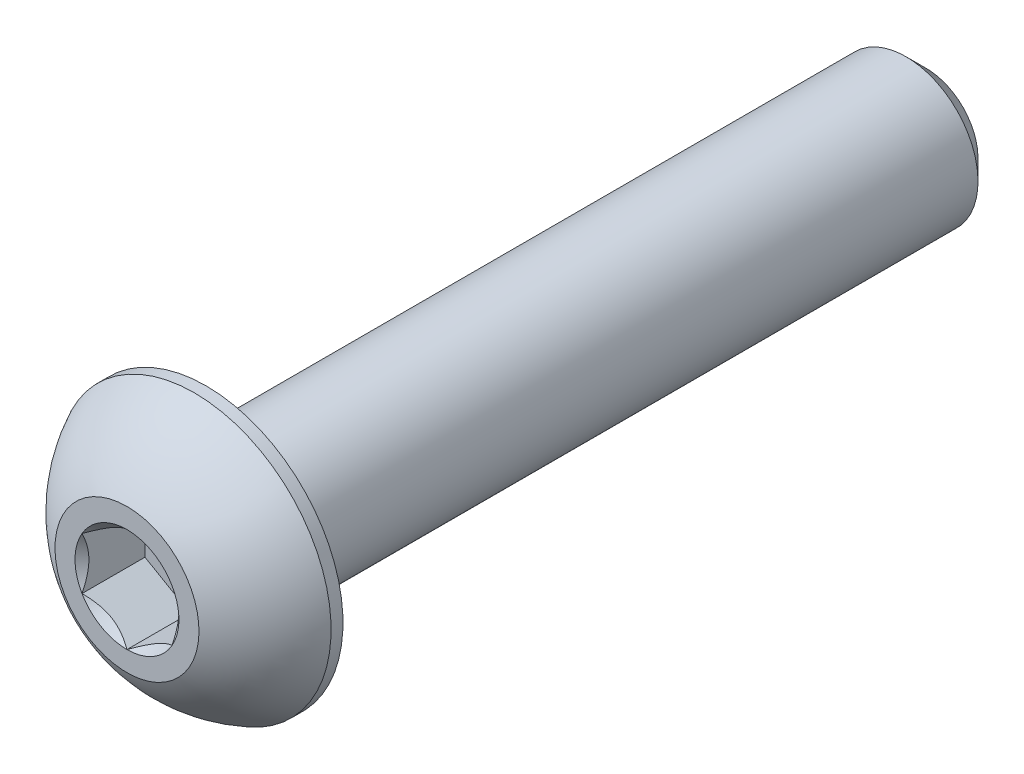
ISO-10303-21;
HEADER;
FILE_DESCRIPTION(('STEP AP214'),'2;1');
FILE_NAME('part.step','',(''),(''),'','','');
FILE_SCHEMA(('AUTOMOTIVE_DESIGN { 1 0 10303 214 1 1 1 1 }'));
ENDSEC;
DATA;
#1=APPLICATION_CONTEXT('core data for automotive mechanical design processes');
#2=APPLICATION_PROTOCOL_DEFINITION('international standard','automotive_design',2000,#1);
#3=PRODUCT_CONTEXT('',#1,'mechanical');
#4=PRODUCT('Part','Part','',(#3));
#5=PRODUCT_RELATED_PRODUCT_CATEGORY('part','',(#4));
#6=PRODUCT_DEFINITION_FORMATION('','',#4);
#7=PRODUCT_DEFINITION_CONTEXT('part definition',#1,'design');
#8=PRODUCT_DEFINITION('design','',#6,#7);
#9=PRODUCT_DEFINITION_SHAPE('','',#8);
#10=(LENGTH_UNIT() NAMED_UNIT(*) SI_UNIT(.MILLI.,.METRE.));
#11=(NAMED_UNIT(*) PLANE_ANGLE_UNIT() SI_UNIT($,.RADIAN.));
#12=(NAMED_UNIT(*) SI_UNIT($,.STERADIAN.) SOLID_ANGLE_UNIT());
#13=UNCERTAINTY_MEASURE_WITH_UNIT(LENGTH_MEASURE(1.E-05),#10,'distance_accuracy_value','');
#14=(GEOMETRIC_REPRESENTATION_CONTEXT(3) GLOBAL_UNCERTAINTY_ASSIGNED_CONTEXT((#13)) GLOBAL_UNIT_ASSIGNED_CONTEXT((#10,
#11,#12)) REPRESENTATION_CONTEXT('',''));
#15=CARTESIAN_POINT('',(0.,0.,0.));
#16=DIRECTION('',(0.,0.,1.));
#17=DIRECTION('',(1.,0.,0.));
#18=AXIS2_PLACEMENT_3D('',#15,#16,#17);
#19=CARTESIAN_POINT('',(0.,0.,11.1));
#20=DIRECTION('',(0.,0.,-1.));
#21=DIRECTION('',(0.,1.,0.));
#22=AXIS2_PLACEMENT_3D('',#19,#20,#21);
#23=PLANE('',#22);
#24=CARTESIAN_POINT('',(0.,0.,11.1));
#25=DIRECTION('',(0.,0.,1.));
#26=DIRECTION('',(1.,0.,0.));
#27=AXIS2_PLACEMENT_3D('',#24,#25,#26);
#28=CIRCLE('',#27,1.44337567297406);
#29=CARTESIAN_POINT('',(0.,1.44337567297406,11.1));
#30=VERTEX_POINT('',#29);
#31=CARTESIAN_POINT('',(-1.25,0.721687836487033,11.1));
#32=VERTEX_POINT('',#31);
#33=EDGE_CURVE('E216',#30,#32,#28,.T.);
#34=ORIENTED_EDGE('',*,*,#33,.F.);
#35=CARTESIAN_POINT('',(1.25,0.721687836487032,11.1));
#36=VERTEX_POINT('',#35);
#37=EDGE_CURVE('E218',#36,#30,#28,.T.);
#38=ORIENTED_EDGE('',*,*,#37,.F.);
#39=CARTESIAN_POINT('',(1.25,-0.721687836487032,11.1));
#40=VERTEX_POINT('',#39);
#41=EDGE_CURVE('E56',#40,#36,#28,.T.);
#42=ORIENTED_EDGE('',*,*,#41,.F.);
#43=CARTESIAN_POINT('',(0.,-1.44337567297406,11.1));
#44=VERTEX_POINT('',#43);
#45=EDGE_CURVE('E63',#44,#40,#28,.T.);
#46=ORIENTED_EDGE('',*,*,#45,.F.);
#47=CARTESIAN_POINT('',(-1.25,-0.721687836487033,11.1));
#48=VERTEX_POINT('',#47);
#49=EDGE_CURVE('E223',#48,#44,#28,.T.);
#50=ORIENTED_EDGE('',*,*,#49,.F.);
#51=EDGE_CURVE('E220',#32,#48,#28,.T.);
#52=ORIENTED_EDGE('',*,*,#51,.F.);
#53=EDGE_LOOP('',(#34,#38,#42,#46,#50,#52));
#54=FACE_BOUND('',#53,.T.);
#55=CARTESIAN_POINT('',(0.,0.,11.1));
#56=DIRECTION('',(0.,0.,1.));
#57=DIRECTION('',(0.,-1.,0.));
#58=AXIS2_PLACEMENT_3D('',#55,#56,#57);
#59=CIRCLE('',#58,2.);
#60=CARTESIAN_POINT('',(0.,2.,11.1));
#61=VERTEX_POINT('',#60);
#62=EDGE_CURVE('E50',#61,#61,#59,.T.);
#63=ORIENTED_EDGE('',*,*,#62,.T.);
#64=EDGE_LOOP('',(#63));
#65=FACE_BOUND('',#64,.T.);
#66=ADVANCED_FACE('F37',(#54,#65),#23,.F.);
#67=CARTESIAN_POINT('',(0.,0.,7.37355614973262));
#68=DIRECTION('',(0.,0.,1.));
#69=DIRECTION('',(0.,1.,0.));
#70=AXIS2_PLACEMENT_3D('',#67,#68,#69);
#71=SPHERICAL_SURFACE('',#70,4.22922968981298);
#72=CARTESIAN_POINT('',(0.,0.,9.23));
#73=DIRECTION('',(0.,0.,1.));
#74=DIRECTION('',(0.,-1.,0.));
#75=AXIS2_PLACEMENT_3D('',#72,#73,#74);
#76=CIRCLE('',#75,3.8);
#77=CARTESIAN_POINT('',(0.,3.8,9.23));
#78=VERTEX_POINT('',#77);
#79=EDGE_CURVE('E162',#78,#78,#76,.T.);
#80=CARTESIAN_POINT('',(0.,2.,11.1));
#81=CARTESIAN_POINT('',(0.,2.02421343985613,11.0870045740355));
#82=CARTESIAN_POINT('',(0.,2.04830018323974,11.0737730870349));
#83=CARTESIAN_POINT('',(0.,2.09621120342125,11.0468431584943));
#84=CARTESIAN_POINT('',(0.,2.12003548021917,11.0331447169543));
#85=CARTESIAN_POINT('',(0.,2.16741249358867,11.005286046868));
#86=CARTESIAN_POINT('',(0.,2.19096523016025,10.9911258183216));
#87=CARTESIAN_POINT('',(0.,2.23779021933682,10.962348964764));
#88=CARTESIAN_POINT('',(0.,2.2610624719418,10.9477323397528));
#89=CARTESIAN_POINT('',(0.,2.30731764886071,10.9180482444859));
#90=CARTESIAN_POINT('',(0.,2.33030057317464,10.9029807742302));
#91=CARTESIAN_POINT('',(0.,2.37596836104235,10.8724007144171));
#92=CARTESIAN_POINT('',(0.,2.39865322459612,10.8568881248597));
#93=CARTESIAN_POINT('',(0.,2.44371627121513,10.8254237206041));
#94=CARTESIAN_POINT('',(0.,2.46609445428037,10.8094719059059));
#95=CARTESIAN_POINT('',(0.,2.51053563686181,10.7771351126683));
#96=CARTESIAN_POINT('',(0.,2.532598636378,10.7607501341289));
#97=CARTESIAN_POINT('',(0.,2.57640106852492,10.7275532390328));
#98=CARTESIAN_POINT('',(0.,2.59814050115564,10.7107413224761));
#99=CARTESIAN_POINT('',(0.,2.64128753915153,10.6766969394119));
#100=CARTESIAN_POINT('',(0.,2.66269514451671,10.6594644729043));
#101=CARTESIAN_POINT('',(0.,2.70517039368395,10.624585537797));
#102=CARTESIAN_POINT('',(0.,2.72623803748602,10.6069390691974));
#103=CARTESIAN_POINT('',(0.,2.76802535840618,10.5712388350756));
#104=CARTESIAN_POINT('',(0.,2.78874503552428,10.5531850695534));
#105=CARTESIAN_POINT('',(0.,2.82982855017313,10.5166771015172));
#106=CARTESIAN_POINT('',(0.,2.85019238770389,10.4982228990032));
#107=CARTESIAN_POINT('',(0.,2.89055648548394,10.460921069069));
#108=CARTESIAN_POINT('',(0.,2.91055674573324,10.4420734416488));
#109=CARTESIAN_POINT('',(0.,2.95018608940552,10.4039919234787));
#110=CARTESIAN_POINT('',(0.,2.96981517282852,10.3847580327288));
#111=CARTESIAN_POINT('',(0.,3.00869470434027,10.3459112962447));
#112=CARTESIAN_POINT('',(0.,3.02794515242903,10.3262984505106));
#113=CARTESIAN_POINT('',(0.,3.06606009863533,10.2867012563963));
#114=CARTESIAN_POINT('',(0.,3.08492459675286,10.2667169080161));
#115=CARTESIAN_POINT('',(0.,3.12226047503002,10.2263843021083));
#116=CARTESIAN_POINT('',(0.,3.14073185518964,10.2060360445808));
#117=CARTESIAN_POINT('',(0.,3.17727447893821,10.1649833521526));
#118=CARTESIAN_POINT('',(0.,3.19534572252715,10.1442789172519));
#119=CARTESIAN_POINT('',(0.,3.23108120656242,10.102521737189));
#120=CARTESIAN_POINT('',(0.,3.24874544700875,10.0814689920269));
#121=CARTESIAN_POINT('',(0.,3.28366021283673,10.039023190901));
#122=CARTESIAN_POINT('',(0.,3.30091073821838,10.0176301349374));
#123=CARTESIAN_POINT('',(0.,3.33499151919534,9.97451184097717));
#124=CARTESIAN_POINT('',(0.,3.35182177479064,9.95278660298064));
#125=CARTESIAN_POINT('',(0.,3.38505562116371,9.9090121999432));
#126=CARTESIAN_POINT('',(0.,3.40145921194149,9.88696303490229));
#127=CARTESIAN_POINT('',(0.,3.43383349577046,9.84254915584848));
#128=CARTESIAN_POINT('',(0.,3.44980418882166,9.8201844418356));
#129=CARTESIAN_POINT('',(0.,3.48130660877275,9.77514796280767));
#130=CARTESIAN_POINT('',(0.,3.49683833567264,9.75247619779264));
#131=CARTESIAN_POINT('',(0.,3.52745692170931,9.70683423141033));
#132=CARTESIAN_POINT('',(0.,3.5425437808461,9.68386403004306));
#133=CARTESIAN_POINT('',(0.,3.57226689871518,9.63763391896935));
#134=CARTESIAN_POINT('',(0.,3.58690315744747,9.61437400926291));
#135=CARTESIAN_POINT('',(0.,3.61571951333199,9.5675733197334));
#136=CARTESIAN_POINT('',(0.,3.62989961048422,9.54403253991033));
#137=CARTESIAN_POINT('',(0.,3.65779825442823,9.4966790546141));
#138=CARTESIAN_POINT('',(0.,3.67151680122002,9.47286634914094));
#139=CARTESIAN_POINT('',(0.,3.69848713452321,9.42497806212234));
#140=CARTESIAN_POINT('',(0.,3.71173892103461,9.4009024805769));
#141=CARTESIAN_POINT('',(0.,3.73777068821038,9.35249758420785));
#142=CARTESIAN_POINT('',(0.,3.75055066887474,9.32816826938424));
#143=CARTESIAN_POINT('',(0.,3.77563400658953,9.27926517055481));
#144=CARTESIAN_POINT('',(0.,3.78793736363997,9.25469138654898));
#145=CARTESIAN_POINT('',(0.,3.8,9.23));
#146=B_SPLINE_CURVE_WITH_KNOTS('',3,(#80,#81,#82,#83,#84,#85,#86,#87,#88,#89,#90,#91,#92,#93,
#94,#95,#96,#97,#98,#99,#100,#101,#102,#103,#104,#105,#106,#107,#108,#109,#110,#111,#112,#113,
#114,#115,#116,#117,#118,#119,#120,#121,#122,#123,#124,#125,#126,#127,#128,#129,#130,#131,#132,
#133,#134,#135,#136,#137,#138,#139,#140,#141,#142,#143,#144,#145),.UNSPECIFIED.,.F.,.F.,(4,2,2,
2,2,2,2,2,2,2,2,2,2,2,2,2,2,2,2,2,2,2,2,2,2,2,2,2,2,2,2,2,4),(0.,0.0824398589102654,
0.164879717820528,0.247319576730793,0.329759435641057,0.412199294551322,0.494639153461587,
0.577079012371851,0.659518871282115,0.741958730192379,0.824398589102644,0.906838448012908,
0.989278306923172,1.07171816583344,1.1541580247437,1.23659788365397,1.31903774256423,
1.40147760147449,1.48391746038476,1.56635731929502,1.64879717820529,1.73123703711555,
1.81367689602582,1.89611675493608,1.97855661384634,2.06099647275661,2.14343633166687,
2.22587619057714,2.3083160494874,2.39075590839767,2.47319576730793,2.5556356262182,
2.63807548512846),.UNSPECIFIED.);
#147=EDGE_CURVE('BSEAM168',#61,#78,#146,.T.);
#148=ORIENTED_EDGE('',*,*,#62,.F.);
#149=ORIENTED_EDGE('',*,*,#79,.T.);
#150=ORIENTED_EDGE('',*,*,#147,.T.);
#151=ORIENTED_EDGE('',*,*,#147,.F.);
#152=EDGE_LOOP('',(#148,#150,#149,#151));
#153=FACE_BOUND('',#152,.T.);
#154=ADVANCED_FACE('F168',(#153),#71,.T.);
#155=CARTESIAN_POINT('',(0.,0.,11.1));
#156=DIRECTION('',(0.,0.,1.));
#157=DIRECTION('',(0.,-1.,0.));
#158=AXIS2_PLACEMENT_3D('',#155,#156,#157);
#159=CYLINDRICAL_SURFACE('',#158,3.8);
#160=ORIENTED_EDGE('',*,*,#79,.F.);
#161=EDGE_LOOP('',(#160));
#162=FACE_BOUND('',#161,.T.);
#163=CARTESIAN_POINT('',(0.,0.,8.9));
#164=DIRECTION('',(0.,0.,1.));
#165=DIRECTION('',(0.,-1.,0.));
#166=AXIS2_PLACEMENT_3D('',#163,#164,#165);
#167=CIRCLE('',#166,3.8);
#168=CARTESIAN_POINT('',(0.,-3.8,8.9));
#169=VERTEX_POINT('',#168);
#170=EDGE_CURVE('E159',#169,#169,#167,.T.);
#171=ORIENTED_EDGE('',*,*,#170,.T.);
#172=EDGE_LOOP('',(#171));
#173=FACE_BOUND('',#172,.T.);
#174=ADVANCED_FACE('F171',(#162,#173),#159,.T.);
#175=CARTESIAN_POINT('',(0.,2.,8.9));
#176=DIRECTION('',(0.,0.,1.));
#177=DIRECTION('',(0.,-1.,0.));
#178=AXIS2_PLACEMENT_3D('',#175,#176,#177);
#179=PLANE('',#178);
#180=ORIENTED_EDGE('',*,*,#170,.F.);
#181=EDGE_LOOP('',(#180));
#182=FACE_BOUND('',#181,.T.);
#183=CARTESIAN_POINT('',(0.,0.,8.9));
#184=DIRECTION('',(0.,0.,1.));
#185=DIRECTION('',(0.,-1.,0.));
#186=AXIS2_PLACEMENT_3D('',#183,#184,#185);
#187=CIRCLE('',#186,1.99999999999999);
#188=CARTESIAN_POINT('',(0.,-1.99999999999999,8.9));
#189=VERTEX_POINT('',#188);
#190=EDGE_CURVE('E156',#189,#189,#187,.T.);
#191=ORIENTED_EDGE('',*,*,#190,.T.);
#192=EDGE_LOOP('',(#191));
#193=FACE_BOUND('',#192,.T.);
#194=ADVANCED_FACE('F176',(#182,#193),#179,.F.);
#195=CARTESIAN_POINT('',(0.,0.,11.1));
#196=DIRECTION('',(0.,0.,1.));
#197=DIRECTION('',(0.,-1.,0.));
#198=AXIS2_PLACEMENT_3D('',#195,#196,#197);
#199=CYLINDRICAL_SURFACE('',#198,1.99999999999999);
#200=ORIENTED_EDGE('',*,*,#190,.F.);
#201=EDGE_LOOP('',(#200));
#202=FACE_BOUND('',#201,.T.);
#203=CARTESIAN_POINT('',(0.,0.,-10.54));
#204=DIRECTION('',(0.,0.,1.));
#205=DIRECTION('',(0.,-1.,0.));
#206=AXIS2_PLACEMENT_3D('',#203,#204,#205);
#207=CIRCLE('',#206,2.);
#208=CARTESIAN_POINT('',(0.,-1.99999999999999,-10.54));
#209=VERTEX_POINT('',#208);
#210=EDGE_CURVE('E153',#209,#209,#207,.T.);
#211=ORIENTED_EDGE('',*,*,#210,.T.);
#212=EDGE_LOOP('',(#211));
#213=FACE_BOUND('',#212,.T.);
#214=ADVANCED_FACE('F182',(#202,#213),#199,.T.);
#215=CARTESIAN_POINT('',(0.,0.,-11.1));
#216=DIRECTION('',(0.,0.,1.));
#217=DIRECTION('',(0.,-1.,0.));
#218=AXIS2_PLACEMENT_3D('',#215,#216,#217);
#219=CONICAL_SURFACE('',#218,1.44,0.785398163397439);
#220=ORIENTED_EDGE('',*,*,#210,.F.);
#221=EDGE_LOOP('',(#220));
#222=FACE_BOUND('',#221,.T.);
#223=CARTESIAN_POINT('',(0.,0.,-11.1));
#224=DIRECTION('',(0.,0.,1.));
#225=DIRECTION('',(0.,-1.,0.));
#226=AXIS2_PLACEMENT_3D('',#223,#224,#225);
#227=CIRCLE('',#226,1.44);
#228=CARTESIAN_POINT('',(0.,-1.44,-11.1));
#229=VERTEX_POINT('',#228);
#230=EDGE_CURVE('E140',#229,#229,#227,.T.);
#231=ORIENTED_EDGE('',*,*,#230,.T.);
#232=EDGE_LOOP('',(#231));
#233=FACE_BOUND('',#232,.T.);
#234=ADVANCED_FACE('F188',(#222,#233),#219,.T.);
#235=CARTESIAN_POINT('',(0.,0.,-11.1));
#236=DIRECTION('',(0.,0.,1.));
#237=DIRECTION('',(0.,-1.,0.));
#238=AXIS2_PLACEMENT_3D('',#235,#236,#237);
#239=PLANE('',#238);
#240=ORIENTED_EDGE('',*,*,#230,.F.);
#241=EDGE_LOOP('',(#240));
#242=FACE_BOUND('',#241,.T.);
#243=ADVANCED_FACE('F194',(#242),#239,.F.);
#244=CARTESIAN_POINT('',(0.,0.,11.1));
#245=DIRECTION('',(0.,0.,1.));
#246=DIRECTION('',(1.,0.,0.));
#247=AXIS2_PLACEMENT_3D('',#244,#245,#246);
#248=CONICAL_SURFACE('',#247,1.44337567297406,0.78539816339745);
#249=ORIENTED_EDGE('',*,*,#33,.T.);
#250=CARTESIAN_POINT('',(0.000199999999999687,1.4434911430279,11.1001154839091));
#251=CARTESIAN_POINT('',(-0.0427751670715868,1.41867941875065,11.0753216680551));
#252=CARTESIAN_POINT('',(-0.0864690047459482,1.39345276980743,11.0519837344187));
#253=CARTESIAN_POINT('',(-0.175565930841942,1.34201263554194,11.0092520040845));
#254=CARTESIAN_POINT('',(-0.220977498357065,1.31579425481276,10.9898819923604));
#255=CARTESIAN_POINT('',(-0.31254782093526,1.26292610442246,10.9567004834135));
#256=CARTESIAN_POINT('',(-0.358683240175886,1.23628980770471,10.9428055590527));
#257=CARTESIAN_POINT('',(-0.451970080407593,1.18243062538508,10.9213972821606));
#258=CARTESIAN_POINT('',(-0.499118649136381,1.15520938653761,10.9138679415668));
#259=CARTESIAN_POINT('',(-0.580373556887254,1.10829684367467,10.9070744980507));
#260=CARTESIAN_POINT('',(-0.614374876627942,1.08866617256958,10.9060685591043));
#261=CARTESIAN_POINT('',(-0.682317764432479,1.04943932800611,10.9077614149113));
#262=CARTESIAN_POINT('',(-0.716259317655659,1.02984316311599,10.9104610272155));
#263=CARTESIAN_POINT('',(-0.783814856457501,0.990839954603499,10.9194089303164));
#264=CARTESIAN_POINT('',(-0.817428507286776,0.971433104248771,10.9256605258997));
#265=CARTESIAN_POINT('',(-0.884094638217814,0.932943395609905,10.9413756814139));
#266=CARTESIAN_POINT('',(-0.917146871030297,0.9138606800983,10.9508406200875));
#267=CARTESIAN_POINT('',(-1.00179969160026,0.864986351354568,10.9789313906876));
#268=CARTESIAN_POINT('',(-1.05286649242964,0.835502920149076,10.9996701574522));
#269=CARTESIAN_POINT('',(-1.15300085411325,0.777690319475909,11.0463871346715));
#270=CARTESIAN_POINT('',(-1.20207431157827,0.749357745598417,11.0723482959468));
#271=CARTESIAN_POINT('',(-1.2502,0.721572366433195,11.1001154839091));
#272=B_SPLINE_CURVE_WITH_KNOTS('',3,(#250,#251,#252,#253,#254,#255,#256,#257,#258,#259,#260,
#261,#262,#263,#264,#265,#266,#267,#268,#269,#270,#271),.UNSPECIFIED.,.F.,.F.,(4,2,2,2,2,2,2,2,
2,2,4),(0.,0.166533409618304,0.334037607289762,0.498880396489698,0.663307919240275,
0.780963963458827,0.898645970148454,1.01643764860773,1.1342799317155,1.32148652032141,
1.50809158792573),.UNSPECIFIED.);
#273=EDGE_CURVE('E11',#30,#32,#272,.T.);
#274=ORIENTED_EDGE('',*,*,#273,.F.);
#275=EDGE_LOOP('',(#249,#274));
#276=FACE_BOUND('',#275,.T.);
#277=ADVANCED_FACE('F199',(#276),#248,.F.);
#278=ORIENTED_EDGE('',*,*,#51,.T.);
#279=CARTESIAN_POINT('',(-1.25,-1.43934010808077,11.5629820968923));
#280=CARTESIAN_POINT('',(-1.25,-1.40429313005659,11.5365249226329));
#281=CARTESIAN_POINT('',(-1.25,-1.36905087135599,11.5103271603543));
#282=CARTESIAN_POINT('',(-1.25,-1.29809650706311,11.4585575718396));
#283=CARTESIAN_POINT('',(-1.25,-1.26238428576495,11.4329859043563));
#284=CARTESIAN_POINT('',(-1.25,-1.15390111792708,11.3570059936895));
#285=CARTESIAN_POINT('',(-1.25,-1.08031646726264,11.3077402861896));
#286=CARTESIAN_POINT('',(-1.25,-0.926012322755094,11.2110258302631));
#287=CARTESIAN_POINT('',(-1.25,-0.845125318656146,11.1638412989418));
#288=CARTESIAN_POINT('',(-1.25,-0.679311174076602,11.0775307343904));
#289=CARTESIAN_POINT('',(-1.25,-0.594398891026688,11.0383775346269));
#290=CARTESIAN_POINT('',(-1.25,-0.46694481246074,10.9904772236883));
#291=CARTESIAN_POINT('',(-1.25,-0.426289985812822,10.9767294897863));
#292=CARTESIAN_POINT('',(-1.25,-0.343998850091268,10.9524979274505));
#293=CARTESIAN_POINT('',(-1.25,-0.302362473614963,10.9420143238698));
#294=CARTESIAN_POINT('',(-1.25,-0.219052696285666,10.9250301617483));
#295=CARTESIAN_POINT('',(-1.25,-0.177393428474501,10.9184613604714));
#296=CARTESIAN_POINT('',(-1.25,-0.0936293693401928,10.9094350534578));
#297=CARTESIAN_POINT('',(-1.25,-0.0515246558543968,10.9069768409973));
#298=CARTESIAN_POINT('',(-1.25,0.0311890576306307,10.9063540620133));
#299=CARTESIAN_POINT('',(-1.25,0.0717969625499295,10.9080371168462));
#300=CARTESIAN_POINT('',(-1.25,0.152668636885196,10.9152682705979));
#301=CARTESIAN_POINT('',(-1.25,0.192932338835357,10.9208171104131));
#302=CARTESIAN_POINT('',(-1.25,0.273499879165295,10.935571036465));
#303=CARTESIAN_POINT('',(-1.25,0.313792180618511,10.9448381759641));
#304=CARTESIAN_POINT('',(-1.25,0.393496413911457,10.9665361784573));
#305=CARTESIAN_POINT('',(-1.25,0.432908419115059,10.9789667767306));
#306=CARTESIAN_POINT('',(-1.25,0.556992735862297,11.0227793529314));
#307=CARTESIAN_POINT('',(-1.25,0.639898924666084,11.059151072876));
#308=CARTESIAN_POINT('',(-1.25,0.8018165554997,11.1400191621783));
#309=CARTESIAN_POINT('',(-1.25,0.880812666325043,11.184544720912));
#310=CARTESIAN_POINT('',(-1.25,1.0317856127975,11.2764048766666));
#311=CARTESIAN_POINT('',(-1.25,1.10391618485086,11.3234899339162));
#312=CARTESIAN_POINT('',(-1.25,1.2101860604331,11.3962785615985));
#313=CARTESIAN_POINT('',(-1.25,1.24515069969379,11.4207980853934));
#314=CARTESIAN_POINT('',(-1.25,1.31460220852736,11.4704856367657));
#315=CARTESIAN_POINT('',(-1.25,1.34908920596618,11.4956534854155));
#316=CARTESIAN_POINT('',(-1.25,1.38337731682911,11.5210901488412));
#317=B_SPLINE_CURVE_WITH_KNOTS('',3,(#279,#280,#281,#282,#283,#284,#285,#286,#287,#288,#289,
#290,#291,#292,#293,#294,#295,#296,#297,#298,#299,#300,#301,#302,#303,#304,#305,#306,#307,#308,
#309,#310,#311,#312,#313,#314,#315,#316),.UNSPECIFIED.,.F.,.F.,(4,2,2,2,2,2,2,2,2,2,2,2,2,2,2,2,
2,2,4),(0.,0.131732960381448,0.263498984161645,0.529042014455828,0.80974192613462,
1.08947609717225,1.21811634272577,1.346765447839,1.47310084517844,1.59941451973784,
1.72115042167849,1.84290966131735,1.96679153905342,2.09066305366039,2.36146692896009,
2.63325989198491,2.89154668212279,3.01965734507713,3.14773302245628),.UNSPECIFIED.);
#318=EDGE_CURVE('E222',#32,#48,#317,.F.);
#319=ORIENTED_EDGE('',*,*,#318,.F.);
#320=EDGE_LOOP('',(#278,#319));
#321=FACE_BOUND('',#320,.T.);
#322=ADVANCED_FACE('F205',(#321),#248,.F.);
#323=ORIENTED_EDGE('',*,*,#49,.T.);
#324=CARTESIAN_POINT('',(-1.2502,-0.721572366433194,11.1001154839091));
#325=CARTESIAN_POINT('',(-1.20722483292841,-0.746384090710444,11.0753216680551));
#326=CARTESIAN_POINT('',(-1.16353099525405,-0.771610739653664,11.0519837344187));
#327=CARTESIAN_POINT('',(-1.07443406915806,-0.823050873919154,11.0092520040845));
#328=CARTESIAN_POINT('',(-1.02902250164294,-0.849269254648333,10.9898819923604));
#329=CARTESIAN_POINT('',(-0.93745217906474,-0.902137405038635,10.9567004834135));
#330=CARTESIAN_POINT('',(-0.891316759824114,-0.928773701756387,10.9428055590527));
#331=CARTESIAN_POINT('',(-0.798029919592407,-0.982632884076013,10.9213972821606));
#332=CARTESIAN_POINT('',(-0.750881350863619,-1.00985412292348,10.9138679415668));
#333=CARTESIAN_POINT('',(-0.669626443112747,-1.05676666578643,10.9070744980507));
#334=CARTESIAN_POINT('',(-0.635625123372058,-1.07639733689152,10.9060685591043));
#335=CARTESIAN_POINT('',(-0.567682235567522,-1.11562418145499,10.9077614149113));
#336=CARTESIAN_POINT('',(-0.533740682344341,-1.1352203463451,10.9104610272155));
#337=CARTESIAN_POINT('',(-0.466185143542499,-1.1742235548576,10.9194089303164));
#338=CARTESIAN_POINT('',(-0.432571492713224,-1.19363040521233,10.9256605258997));
#339=CARTESIAN_POINT('',(-0.365905361782186,-1.23212011385119,10.9413756814139));
#340=CARTESIAN_POINT('',(-0.332853128969704,-1.2512028293628,10.9508406200875));
#341=CARTESIAN_POINT('',(-0.248200308399735,-1.30007715810653,10.9789313906876));
#342=CARTESIAN_POINT('',(-0.197133507570362,-1.32956058931202,10.9996701574522));
#343=CARTESIAN_POINT('',(-0.0969991458867454,-1.38737318998519,11.0463871346715));
#344=CARTESIAN_POINT('',(-0.047925688421731,-1.41570576386268,11.0723482959468));
#345=CARTESIAN_POINT('',(0.000199999999999445,-1.4434911430279,11.1001154839091));
#346=B_SPLINE_CURVE_WITH_KNOTS('',3,(#324,#325,#326,#327,#328,#329,#330,#331,#332,#333,#334,
#335,#336,#337,#338,#339,#340,#341,#342,#343,#344,#345),.UNSPECIFIED.,.F.,.F.,(4,2,2,2,2,2,2,2,
2,2,4),(0.,0.166533409618303,0.334037607289761,0.498880396489698,0.663307919240275,
0.780963963458828,0.898645970148454,1.01643764860773,1.1342799317155,1.32148652032141,
1.50809158792573),.UNSPECIFIED.);
#347=EDGE_CURVE('E232',#48,#44,#346,.T.);
#348=ORIENTED_EDGE('',*,*,#347,.F.);
#349=EDGE_LOOP('',(#323,#348));
#350=FACE_BOUND('',#349,.T.);
#351=ADVANCED_FACE('F282',(#350),#248,.F.);
#352=ORIENTED_EDGE('',*,*,#45,.T.);
#353=CARTESIAN_POINT('',(-0.000200000000000272,-1.4434911430279,11.1001154839091));
#354=CARTESIAN_POINT('',(0.0427751670715864,-1.41867941875065,11.0753216680551));
#355=CARTESIAN_POINT('',(0.0864690047459479,-1.39345276980743,11.0519837344187));
#356=CARTESIAN_POINT('',(0.175565930841942,-1.34201263554194,11.0092520040845));
#357=CARTESIAN_POINT('',(0.220977498357064,-1.31579425481276,10.9898819923604));
#358=CARTESIAN_POINT('',(0.31254782093526,-1.26292610442246,10.9567004834135));
#359=CARTESIAN_POINT('',(0.358683240175886,-1.23628980770471,10.9428055590527));
#360=CARTESIAN_POINT('',(0.451970080407593,-1.18243062538508,10.9213972821606));
#361=CARTESIAN_POINT('',(0.49911864913638,-1.15520938653761,10.9138679415668));
#362=CARTESIAN_POINT('',(0.580373556887253,-1.10829684367467,10.9070744980507));
#363=CARTESIAN_POINT('',(0.614374876627942,-1.08866617256958,10.9060685591043));
#364=CARTESIAN_POINT('',(0.682317764432478,-1.04943932800611,10.9077614149113));
#365=CARTESIAN_POINT('',(0.716259317655658,-1.02984316311599,10.9104610272155));
#366=CARTESIAN_POINT('',(0.783814856457501,-0.990839954603498,10.9194089303164));
#367=CARTESIAN_POINT('',(0.817428507286776,-0.97143310424877,10.9256605258997));
#368=CARTESIAN_POINT('',(0.884094638217814,-0.932943395609904,10.9413756814139));
#369=CARTESIAN_POINT('',(0.917146871030297,-0.913860680098299,10.9508406200875));
#370=CARTESIAN_POINT('',(1.00179969160026,-0.864986351354567,10.9789313906876));
#371=CARTESIAN_POINT('',(1.05286649242964,-0.835502920149076,10.9996701574522));
#372=CARTESIAN_POINT('',(1.15300085411325,-0.777690319475909,11.0463871346715));
#373=CARTESIAN_POINT('',(1.20207431157827,-0.749357745598417,11.0723482959468));
#374=CARTESIAN_POINT('',(1.2502,-0.721572366433194,11.1001154839091));
#375=B_SPLINE_CURVE_WITH_KNOTS('',3,(#353,#354,#355,#356,#357,#358,#359,#360,#361,#362,#363,
#364,#365,#366,#367,#368,#369,#370,#371,#372,#373,#374),.UNSPECIFIED.,.F.,.F.,(4,2,2,2,2,2,2,2,
2,2,4),(0.,0.166533409618304,0.334037607289762,0.498880396489698,0.663307919240275,
0.780963963458828,0.898645970148454,1.01643764860773,1.1342799317155,1.32148652032141,
1.50809158792574),.UNSPECIFIED.);
#376=EDGE_CURVE('E270',#44,#40,#375,.T.);
#377=ORIENTED_EDGE('',*,*,#376,.F.);
#378=EDGE_LOOP('',(#352,#377));
#379=FACE_BOUND('',#378,.T.);
#380=ADVANCED_FACE('F283',(#379),#248,.F.);
#381=ORIENTED_EDGE('',*,*,#41,.T.);
#382=CARTESIAN_POINT('',(1.25,-1.43934010808077,11.5629820968923));
#383=CARTESIAN_POINT('',(1.25,-1.40429313005659,11.5365249226329));
#384=CARTESIAN_POINT('',(1.25,-1.36905087135599,11.5103271603543));
#385=CARTESIAN_POINT('',(1.25,-1.29809650706311,11.4585575718396));
#386=CARTESIAN_POINT('',(1.25,-1.26238428576495,11.4329859043563));
#387=CARTESIAN_POINT('',(1.25,-1.15390111792708,11.3570059936895));
#388=CARTESIAN_POINT('',(1.25,-1.08031646726264,11.3077402861896));
#389=CARTESIAN_POINT('',(1.25,-0.926012322755096,11.2110258302631));
#390=CARTESIAN_POINT('',(1.25,-0.845125318656147,11.1638412989418));
#391=CARTESIAN_POINT('',(1.25,-0.679311174076603,11.0775307343904));
#392=CARTESIAN_POINT('',(1.25,-0.594398891026688,11.0383775346269));
#393=CARTESIAN_POINT('',(1.25,-0.466944812460741,10.9904772236883));
#394=CARTESIAN_POINT('',(1.25,-0.426289985812822,10.9767294897863));
#395=CARTESIAN_POINT('',(1.25,-0.343998850091268,10.9524979274505));
#396=CARTESIAN_POINT('',(1.25,-0.302362473614963,10.9420143238698));
#397=CARTESIAN_POINT('',(1.25,-0.219052696285666,10.9250301617483));
#398=CARTESIAN_POINT('',(1.25,-0.1773934284745,10.9184613604714));
#399=CARTESIAN_POINT('',(1.25,-0.0936293693401924,10.9094350534578));
#400=CARTESIAN_POINT('',(1.25,-0.0515246558543962,10.9069768409973));
#401=CARTESIAN_POINT('',(1.25,0.0311890576306316,10.9063540620133));
#402=CARTESIAN_POINT('',(1.25,0.0717969625499305,10.9080371168462));
#403=CARTESIAN_POINT('',(1.25,0.152668636885197,10.9152682705979));
#404=CARTESIAN_POINT('',(1.25,0.192932338835358,10.9208171104131));
#405=CARTESIAN_POINT('',(1.25,0.273499879165295,10.935571036465));
#406=CARTESIAN_POINT('',(1.25,0.313792180618511,10.9448381759641));
#407=CARTESIAN_POINT('',(1.25,0.393496413911458,10.9665361784573));
#408=CARTESIAN_POINT('',(1.25,0.432908419115059,10.9789667767306));
#409=CARTESIAN_POINT('',(1.25,0.556992735862298,11.0227793529314));
#410=CARTESIAN_POINT('',(1.25,0.639898924666086,11.059151072876));
#411=CARTESIAN_POINT('',(1.25,0.801816555499702,11.1400191621783));
#412=CARTESIAN_POINT('',(1.25,0.880812666325045,11.184544720912));
#413=CARTESIAN_POINT('',(1.25,1.0317856127975,11.2764048766666));
#414=CARTESIAN_POINT('',(1.25,1.10391618485086,11.3234899339162));
#415=CARTESIAN_POINT('',(1.25,1.21018606043311,11.3962785615985));
#416=CARTESIAN_POINT('',(1.25,1.24515069969379,11.4207980853934));
#417=CARTESIAN_POINT('',(1.25,1.31460220852737,11.4704856367657));
#418=CARTESIAN_POINT('',(1.25,1.34908920596618,11.4956534854155));
#419=CARTESIAN_POINT('',(1.25,1.38337731682912,11.5210901488412));
#420=B_SPLINE_CURVE_WITH_KNOTS('',3,(#382,#383,#384,#385,#386,#387,#388,#389,#390,#391,#392,
#393,#394,#395,#396,#397,#398,#399,#400,#401,#402,#403,#404,#405,#406,#407,#408,#409,#410,#411,
#412,#413,#414,#415,#416,#417,#418,#419),.UNSPECIFIED.,.F.,.F.,(4,2,2,2,2,2,2,2,2,2,2,2,2,2,2,2,
2,2,4),(0.,0.131732960381448,0.263498984161644,0.529042014455825,0.809741926134617,
1.08947609717225,1.21811634272576,1.346765447839,1.47310084517844,1.59941451973784,
1.72115042167849,1.84290966131735,1.96679153905342,2.09066305366039,2.36146692896009,
2.63325989198491,2.89154668212279,3.01965734507713,3.14773302245628),.UNSPECIFIED.);
#421=EDGE_CURVE('E122',#40,#36,#420,.T.);
#422=ORIENTED_EDGE('',*,*,#421,.F.);
#423=EDGE_LOOP('',(#381,#422));
#424=FACE_BOUND('',#423,.T.);
#425=ADVANCED_FACE('F285',(#424),#248,.F.);
#426=ORIENTED_EDGE('',*,*,#37,.T.);
#427=CARTESIAN_POINT('',(1.2502,0.721572366433194,11.1001154839091));
#428=CARTESIAN_POINT('',(1.20722483292841,0.746384090710444,11.0753216680551));
#429=CARTESIAN_POINT('',(1.16353099525405,0.771610739653664,11.0519837344187));
#430=CARTESIAN_POINT('',(1.07443406915806,0.823050873919155,11.0092520040845));
#431=CARTESIAN_POINT('',(1.02902250164294,0.849269254648334,10.9898819923604));
#432=CARTESIAN_POINT('',(0.937452179064739,0.902137405038636,10.9567004834135));
#433=CARTESIAN_POINT('',(0.891316759824113,0.928773701756388,10.9428055590527));
#434=CARTESIAN_POINT('',(0.798029919592406,0.982632884076013,10.9213972821606));
#435=CARTESIAN_POINT('',(0.750881350863619,1.00985412292348,10.9138679415668));
#436=CARTESIAN_POINT('',(0.669626443112746,1.05676666578643,10.9070744980507));
#437=CARTESIAN_POINT('',(0.635625123372058,1.07639733689152,10.9060685591043));
#438=CARTESIAN_POINT('',(0.567682235567521,1.11562418145499,10.9077614149113));
#439=CARTESIAN_POINT('',(0.533740682344341,1.1352203463451,10.9104610272155));
#440=CARTESIAN_POINT('',(0.466185143542499,1.1742235548576,10.9194089303164));
#441=CARTESIAN_POINT('',(0.432571492713224,1.19363040521233,10.9256605258997));
#442=CARTESIAN_POINT('',(0.365905361782185,1.23212011385119,10.9413756814139));
#443=CARTESIAN_POINT('',(0.332853128969703,1.2512028293628,10.9508406200875));
#444=CARTESIAN_POINT('',(0.248200308399734,1.30007715810653,10.9789313906876));
#445=CARTESIAN_POINT('',(0.197133507570361,1.32956058931202,10.9996701574522));
#446=CARTESIAN_POINT('',(0.0969991458867447,1.38737318998519,11.0463871346715));
#447=CARTESIAN_POINT('',(0.0479256884217304,1.41570576386268,11.0723482959468));
#448=CARTESIAN_POINT('',(-0.00019999999999985,1.4434911430279,11.1001154839091));
#449=B_SPLINE_CURVE_WITH_KNOTS('',3,(#427,#428,#429,#430,#431,#432,#433,#434,#435,#436,#437,
#438,#439,#440,#441,#442,#443,#444,#445,#446,#447,#448),.UNSPECIFIED.,.F.,.F.,(4,2,2,2,2,2,2,2,
2,2,4),(0.,0.166533409618304,0.334037607289762,0.498880396489699,0.663307919240276,
0.780963963458828,0.898645970148454,1.01643764860773,1.1342799317155,1.32148652032141,
1.50809158792573),.UNSPECIFIED.);
#450=EDGE_CURVE('E103',#36,#30,#449,.T.);
#451=ORIENTED_EDGE('',*,*,#450,.F.);
#452=EDGE_LOOP('',(#426,#451));
#453=FACE_BOUND('',#452,.T.);
#454=ADVANCED_FACE('F207',(#453),#248,.F.);
#455=CARTESIAN_POINT('',(0.,0.,9.35));
#456=DIRECTION('',(0.,0.,1.));
#457=DIRECTION('',(1.,0.,0.));
#458=AXIS2_PLACEMENT_3D('',#455,#456,#457);
#459=PLANE('',#458);
#460=DIRECTION('',(-0.866025403784439,0.5,0.));
#461=VECTOR('',#460,1.);
#462=CARTESIAN_POINT('',(1.25,0.721687836487032,9.35));
#463=LINE('',#462,#461);
#464=CARTESIAN_POINT('',(1.25,0.721687836487032,9.35));
#465=VERTEX_POINT('',#464);
#466=CARTESIAN_POINT('',(0.,1.44337567297406,9.35));
#467=VERTEX_POINT('',#466);
#468=EDGE_CURVE('E101',#465,#467,#463,.T.);
#469=ORIENTED_EDGE('',*,*,#468,.T.);
#470=DIRECTION('',(-0.866025403784439,-0.5,0.));
#471=VECTOR('',#470,1.);
#472=CARTESIAN_POINT('',(0.,1.44337567297406,9.35));
#473=LINE('',#472,#471);
#474=CARTESIAN_POINT('',(-1.25,0.721687836487033,9.35));
#475=VERTEX_POINT('',#474);
#476=EDGE_CURVE('E110',#467,#475,#473,.T.);
#477=ORIENTED_EDGE('',*,*,#476,.T.);
#478=DIRECTION('',(0.,-1.,0.));
#479=VECTOR('',#478,1.);
#480=CARTESIAN_POINT('',(-1.25,0.721687836487033,9.35));
#481=LINE('',#480,#479);
#482=CARTESIAN_POINT('',(-1.25,-0.721687836487032,9.35));
#483=VERTEX_POINT('',#482);
#484=EDGE_CURVE('E116',#475,#483,#481,.T.);
#485=ORIENTED_EDGE('',*,*,#484,.T.);
#486=DIRECTION('',(0.866025403784439,-0.5,0.));
#487=VECTOR('',#486,1.);
#488=CARTESIAN_POINT('',(-1.25,-0.721687836487032,9.35));
#489=LINE('',#488,#487);
#490=CARTESIAN_POINT('',(0.,-1.44337567297406,9.35));
#491=VERTEX_POINT('',#490);
#492=EDGE_CURVE('E132',#483,#491,#489,.T.);
#493=ORIENTED_EDGE('',*,*,#492,.T.);
#494=DIRECTION('',(0.866025403784439,0.5,0.));
#495=VECTOR('',#494,1.);
#496=CARTESIAN_POINT('',(0.,-1.44337567297406,9.35));
#497=LINE('',#496,#495);
#498=CARTESIAN_POINT('',(1.25,-0.721687836487032,9.35));
#499=VERTEX_POINT('',#498);
#500=EDGE_CURVE('E135',#491,#499,#497,.T.);
#501=ORIENTED_EDGE('',*,*,#500,.T.);
#502=DIRECTION('',(0.,1.,0.));
#503=VECTOR('',#502,1.);
#504=CARTESIAN_POINT('',(1.25,-0.721687836487032,9.35));
#505=LINE('',#504,#503);
#506=EDGE_CURVE('E107',#499,#465,#505,.T.);
#507=ORIENTED_EDGE('',*,*,#506,.T.);
#508=EDGE_LOOP('',(#469,#477,#485,#493,#501,#507));
#509=FACE_BOUND('',#508,.T.);
#510=ADVANCED_FACE('F118',(#509),#459,.T.);
#511=CARTESIAN_POINT('',(0.,1.44337567297406,9.35));
#512=DIRECTION('',(-0.5,0.866025403784439,0.));
#513=DIRECTION('',(-0.866025403784439,-0.5,0.));
#514=AXIS2_PLACEMENT_3D('',#511,#512,#513);
#515=PLANE('',#514);
#516=DIRECTION('',(0.,0.,1.));
#517=VECTOR('',#516,1.);
#518=CARTESIAN_POINT('',(0.,1.44337567297406,9.35));
#519=LINE('',#518,#517);
#520=EDGE_CURVE('E96',#467,#30,#519,.T.);
#521=ORIENTED_EDGE('',*,*,#520,.T.);
#522=ORIENTED_EDGE('',*,*,#273,.T.);
#523=DIRECTION('',(0.,0.,1.));
#524=VECTOR('',#523,1.);
#525=CARTESIAN_POINT('',(-1.25,0.721687836487033,9.35));
#526=LINE('',#525,#524);
#527=EDGE_CURVE('E106',#475,#32,#526,.T.);
#528=ORIENTED_EDGE('',*,*,#527,.F.);
#529=ORIENTED_EDGE('',*,*,#476,.F.);
#530=EDGE_LOOP('',(#521,#522,#528,#529));
#531=FACE_BOUND('',#530,.T.);
#532=ADVANCED_FACE('F111',(#531),#515,.F.);
#533=CARTESIAN_POINT('',(-1.25,0.721687836487033,9.35));
#534=DIRECTION('',(-1.,0.,0.));
#535=DIRECTION('',(0.,0.,1.));
#536=AXIS2_PLACEMENT_3D('',#533,#534,#535);
#537=PLANE('',#536);
#538=ORIENTED_EDGE('',*,*,#527,.T.);
#539=ORIENTED_EDGE('',*,*,#318,.T.);
#540=DIRECTION('',(0.,0.,1.));
#541=VECTOR('',#540,1.);
#542=CARTESIAN_POINT('',(-1.25,-0.721687836487032,9.35));
#543=LINE('',#542,#541);
#544=EDGE_CURVE('E147',#483,#48,#543,.T.);
#545=ORIENTED_EDGE('',*,*,#544,.F.);
#546=ORIENTED_EDGE('',*,*,#484,.F.);
#547=EDGE_LOOP('',(#538,#539,#545,#546));
#548=FACE_BOUND('',#547,.T.);
#549=ADVANCED_FACE('F241',(#548),#537,.F.);
#550=CARTESIAN_POINT('',(-1.25,-0.721687836487032,9.35));
#551=DIRECTION('',(-0.5,-0.866025403784438,0.));
#552=DIRECTION('',(0.866025403784439,-0.5,0.));
#553=AXIS2_PLACEMENT_3D('',#550,#551,#552);
#554=PLANE('',#553);
#555=ORIENTED_EDGE('',*,*,#544,.T.);
#556=ORIENTED_EDGE('',*,*,#347,.T.);
#557=DIRECTION('',(0.,0.,1.));
#558=VECTOR('',#557,1.);
#559=CARTESIAN_POINT('',(0.,-1.44337567297406,9.35));
#560=LINE('',#559,#558);
#561=EDGE_CURVE('E144',#491,#44,#560,.T.);
#562=ORIENTED_EDGE('',*,*,#561,.F.);
#563=ORIENTED_EDGE('',*,*,#492,.F.);
#564=EDGE_LOOP('',(#555,#556,#562,#563));
#565=FACE_BOUND('',#564,.T.);
#566=ADVANCED_FACE('F244',(#565),#554,.F.);
#567=CARTESIAN_POINT('',(0.,-1.44337567297406,9.35));
#568=DIRECTION('',(0.5,-0.866025403784439,0.));
#569=DIRECTION('',(0.866025403784439,0.5,0.));
#570=AXIS2_PLACEMENT_3D('',#567,#568,#569);
#571=PLANE('',#570);
#572=ORIENTED_EDGE('',*,*,#561,.T.);
#573=ORIENTED_EDGE('',*,*,#376,.T.);
#574=DIRECTION('',(0.,0.,1.));
#575=VECTOR('',#574,1.);
#576=CARTESIAN_POINT('',(1.25,-0.721687836487032,9.35));
#577=LINE('',#576,#575);
#578=EDGE_CURVE('E141',#499,#40,#577,.T.);
#579=ORIENTED_EDGE('',*,*,#578,.F.);
#580=ORIENTED_EDGE('',*,*,#500,.F.);
#581=EDGE_LOOP('',(#572,#573,#579,#580));
#582=FACE_BOUND('',#581,.T.);
#583=ADVANCED_FACE('F256',(#582),#571,.F.);
#584=CARTESIAN_POINT('',(1.25,-0.721687836487032,9.35));
#585=DIRECTION('',(1.,0.,0.));
#586=DIRECTION('',(0.,1.,0.));
#587=AXIS2_PLACEMENT_3D('',#584,#585,#586);
#588=PLANE('',#587);
#589=ORIENTED_EDGE('',*,*,#578,.T.);
#590=ORIENTED_EDGE('',*,*,#421,.T.);
#591=DIRECTION('',(0.,0.,1.));
#592=VECTOR('',#591,1.);
#593=CARTESIAN_POINT('',(1.25,0.721687836487032,9.35));
#594=LINE('',#593,#592);
#595=EDGE_CURVE('E138',#465,#36,#594,.T.);
#596=ORIENTED_EDGE('',*,*,#595,.F.);
#597=ORIENTED_EDGE('',*,*,#506,.F.);
#598=EDGE_LOOP('',(#589,#590,#596,#597));
#599=FACE_BOUND('',#598,.T.);
#600=ADVANCED_FACE('F252',(#599),#588,.F.);
#601=CARTESIAN_POINT('',(1.25,0.721687836487032,9.35));
#602=DIRECTION('',(0.5,0.866025403784438,0.));
#603=DIRECTION('',(-0.866025403784439,0.5,0.));
#604=AXIS2_PLACEMENT_3D('',#601,#602,#603);
#605=PLANE('',#604);
#606=ORIENTED_EDGE('',*,*,#595,.T.);
#607=ORIENTED_EDGE('',*,*,#450,.T.);
#608=ORIENTED_EDGE('',*,*,#520,.F.);
#609=ORIENTED_EDGE('',*,*,#468,.F.);
#610=EDGE_LOOP('',(#606,#607,#608,#609));
#611=FACE_BOUND('',#610,.T.);
#612=ADVANCED_FACE('F99',(#611),#605,.F.);
#613=CLOSED_SHELL('',(#66,#154,#174,#194,#214,#234,#243,#277,#322,#351,#380,#425,#454,#510,#532,
#549,#566,#583,#600,#612));
#614=MANIFOLD_SOLID_BREP('B2',#613);
#615=ADVANCED_BREP_SHAPE_REPRESENTATION('',(#18,#614),#14);
#616=SHAPE_DEFINITION_REPRESENTATION(#9,#615);
ENDSEC;
END-ISO-10303-21;
